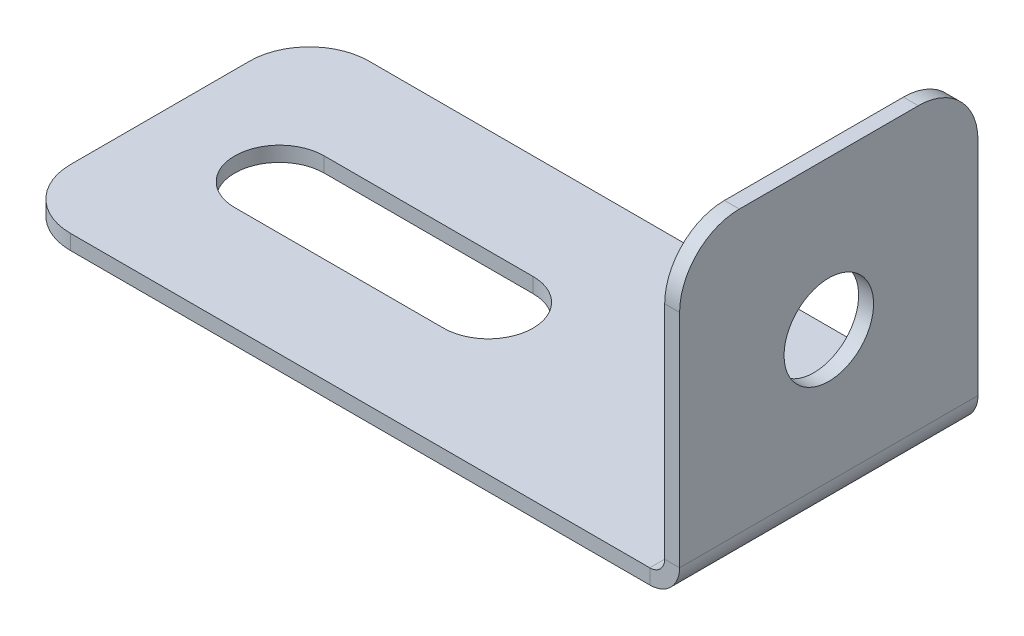
ISO-10303-21;
HEADER;
FILE_DESCRIPTION(('STEP AP214'),'2;1');
FILE_NAME('part.step','',(''),(''),'','','');
FILE_SCHEMA(('AUTOMOTIVE_DESIGN { 1 0 10303 214 1 1 1 1 }'));
ENDSEC;
DATA;
#1=APPLICATION_CONTEXT('core data for automotive mechanical design processes');
#2=APPLICATION_PROTOCOL_DEFINITION('international standard','automotive_design',2000,#1);
#3=PRODUCT_CONTEXT('',#1,'mechanical');
#4=PRODUCT('Part','Part','',(#3));
#5=PRODUCT_RELATED_PRODUCT_CATEGORY('part','',(#4));
#6=PRODUCT_DEFINITION_FORMATION('','',#4);
#7=PRODUCT_DEFINITION_CONTEXT('part definition',#1,'design');
#8=PRODUCT_DEFINITION('design','',#6,#7);
#9=PRODUCT_DEFINITION_SHAPE('','',#8);
#10=(LENGTH_UNIT() NAMED_UNIT(*) SI_UNIT(.MILLI.,.METRE.));
#11=(NAMED_UNIT(*) PLANE_ANGLE_UNIT() SI_UNIT($,.RADIAN.));
#12=(NAMED_UNIT(*) SI_UNIT($,.STERADIAN.) SOLID_ANGLE_UNIT());
#13=UNCERTAINTY_MEASURE_WITH_UNIT(LENGTH_MEASURE(1.E-05),#10,'distance_accuracy_value','');
#14=(GEOMETRIC_REPRESENTATION_CONTEXT(3) GLOBAL_UNCERTAINTY_ASSIGNED_CONTEXT((#13)) GLOBAL_UNIT_ASSIGNED_CONTEXT((#10,
#11,#12)) REPRESENTATION_CONTEXT('',''));
#15=CARTESIAN_POINT('',(0.,0.,0.));
#16=DIRECTION('',(0.,0.,1.));
#17=DIRECTION('',(1.,0.,0.));
#18=AXIS2_PLACEMENT_3D('',#15,#16,#17);
#19=CARTESIAN_POINT('',(6.41095137745193,-5.58904862254808,0.));
#20=DIRECTION('',(-1.,0.,0.));
#21=DIRECTION('',(0.,0.,1.));
#22=AXIS2_PLACEMENT_3D('',#19,#20,#21);
#23=PLANE('',#22);
#24=CARTESIAN_POINT('',(6.4109513774519,5.41095137745192,0.));
#25=DIRECTION('',(-1.,0.,0.));
#26=DIRECTION('',(0.,0.,1.));
#27=AXIS2_PLACEMENT_3D('',#24,#25,#26);
#28=CIRCLE('',#27,1.5);
#29=CARTESIAN_POINT('',(6.4109513774519,5.41095137745192,1.5));
#30=VERTEX_POINT('',#29);
#31=EDGE_CURVE('E225',#30,#30,#28,.T.);
#32=ORIENTED_EDGE('',*,*,#31,.T.);
#33=EDGE_LOOP('',(#32));
#34=FACE_BOUND('',#33,.T.);
#35=DIRECTION('',(0.,1.,0.));
#36=VECTOR('',#35,1.);
#37=CARTESIAN_POINT('',(6.41095137745193,-5.58904862254808,-5.));
#38=LINE('',#37,#36);
#39=CARTESIAN_POINT('',(6.41095137745189,8.41095137745192,-5.));
#40=VERTEX_POINT('',#39);
#41=CARTESIAN_POINT('',(6.41095137745191,1.,-5.));
#42=VERTEX_POINT('',#41);
#43=EDGE_CURVE('E233',#40,#42,#38,.F.);
#44=ORIENTED_EDGE('',*,*,#43,.F.);
#45=CARTESIAN_POINT('',(6.41095137745188,8.41095137745192,-3.));
#46=DIRECTION('',(-1.,0.,0.));
#47=DIRECTION('',(0.,-1.,0.));
#48=AXIS2_PLACEMENT_3D('',#45,#46,#47);
#49=CIRCLE('',#48,2.);
#50=CARTESIAN_POINT('',(6.41095137745188,10.4109513774519,-3.));
#51=VERTEX_POINT('',#50);
#52=EDGE_CURVE('E266',#40,#51,#49,.F.);
#53=ORIENTED_EDGE('',*,*,#52,.T.);
#54=DIRECTION('',(0.,0.,1.));
#55=VECTOR('',#54,1.);
#56=CARTESIAN_POINT('',(6.41095137745188,10.4109513774519,0.));
#57=LINE('',#56,#55);
#58=CARTESIAN_POINT('',(6.41095137745188,10.4109513774519,3.));
#59=VERTEX_POINT('',#58);
#60=EDGE_CURVE('E230',#59,#51,#57,.F.);
#61=ORIENTED_EDGE('',*,*,#60,.F.);
#62=CARTESIAN_POINT('',(6.41095137745188,8.41095137745192,3.));
#63=DIRECTION('',(-1.,0.,0.));
#64=DIRECTION('',(0.,-1.,0.));
#65=AXIS2_PLACEMENT_3D('',#62,#63,#64);
#66=CIRCLE('',#65,2.);
#67=CARTESIAN_POINT('',(6.41095137745188,8.41095137745191,5.));
#68=VERTEX_POINT('',#67);
#69=EDGE_CURVE('E264',#59,#68,#66,.F.);
#70=ORIENTED_EDGE('',*,*,#69,.T.);
#71=DIRECTION('',(0.,1.,0.));
#72=VECTOR('',#71,1.);
#73=CARTESIAN_POINT('',(6.41095137745193,-5.58904862254808,5.));
#74=LINE('',#73,#72);
#75=CARTESIAN_POINT('',(6.41095137745191,1.00000000000001,5.));
#76=VERTEX_POINT('',#75);
#77=EDGE_CURVE('E237',#76,#68,#74,.T.);
#78=ORIENTED_EDGE('',*,*,#77,.F.);
#79=DIRECTION('',(0.,0.,-1.));
#80=VECTOR('',#79,1.);
#81=CARTESIAN_POINT('',(6.41095137745191,1.00000000000001,0.));
#82=LINE('',#81,#80);
#83=EDGE_CURVE('E241',#76,#42,#82,.T.);
#84=ORIENTED_EDGE('',*,*,#83,.T.);
#85=EDGE_LOOP('',(#44,#53,#61,#70,#78,#84));
#86=FACE_BOUND('',#85,.T.);
#87=ADVANCED_FACE('F43',(#34,#86),#23,.F.);
#88=CARTESIAN_POINT('',(5.91095137745199,-21.5890486225481,5.));
#89=DIRECTION('',(0.,0.,1.));
#90=DIRECTION('',(0.,1.,0.));
#91=AXIS2_PLACEMENT_3D('',#88,#89,#90);
#92=PLANE('',#91);
#93=ORIENTED_EDGE('',*,*,#77,.T.);
#94=DIRECTION('',(-1.,0.,0.));
#95=VECTOR('',#94,1.);
#96=CARTESIAN_POINT('',(5.91095137745188,8.41095137745191,5.));
#97=LINE('',#96,#95);
#98=CARTESIAN_POINT('',(5.91095137745188,8.41095137745191,5.));
#99=VERTEX_POINT('',#98);
#100=EDGE_CURVE('E12',#68,#99,#97,.T.);
#101=ORIENTED_EDGE('',*,*,#100,.T.);
#102=DIRECTION('',(0.,1.,0.));
#103=VECTOR('',#102,1.);
#104=CARTESIAN_POINT('',(5.91095137745199,-21.5890486225481,5.));
#105=LINE('',#104,#103);
#106=CARTESIAN_POINT('',(5.91095137745191,1.,5.));
#107=VERTEX_POINT('',#106);
#108=EDGE_CURVE('E229',#107,#99,#105,.T.);
#109=ORIENTED_EDGE('',*,*,#108,.F.);
#110=DIRECTION('',(-1.,0.,0.));
#111=VECTOR('',#110,1.);
#112=CARTESIAN_POINT('',(5.91095137745191,1.,5.));
#113=LINE('',#112,#111);
#114=EDGE_CURVE('E244',#76,#107,#113,.T.);
#115=ORIENTED_EDGE('',*,*,#114,.F.);
#116=EDGE_LOOP('',(#93,#101,#109,#115));
#117=FACE_BOUND('',#116,.T.);
#118=ADVANCED_FACE('F344',(#117),#92,.T.);
#119=CARTESIAN_POINT('',(5.91095137745188,10.4109513774519,-5.));
#120=DIRECTION('',(0.,1.,0.));
#121=DIRECTION('',(0.,0.,-1.));
#122=AXIS2_PLACEMENT_3D('',#119,#120,#121);
#123=PLANE('',#122);
#124=ORIENTED_EDGE('',*,*,#60,.T.);
#125=DIRECTION('',(-1.,0.,0.));
#126=VECTOR('',#125,1.);
#127=CARTESIAN_POINT('',(5.91095137745188,10.4109513774519,-3.));
#128=LINE('',#127,#126);
#129=CARTESIAN_POINT('',(5.91095137745188,10.4109513774519,-3.));
#130=VERTEX_POINT('',#129);
#131=EDGE_CURVE('E255',#51,#130,#128,.T.);
#132=ORIENTED_EDGE('',*,*,#131,.T.);
#133=DIRECTION('',(0.,0.,-1.));
#134=VECTOR('',#133,1.);
#135=CARTESIAN_POINT('',(5.91095137745188,10.4109513774519,-5.));
#136=LINE('',#135,#134);
#137=CARTESIAN_POINT('',(5.91095137745188,10.4109513774519,3.));
#138=VERTEX_POINT('',#137);
#139=EDGE_CURVE('E221',#138,#130,#136,.T.);
#140=ORIENTED_EDGE('',*,*,#139,.F.);
#141=DIRECTION('',(-1.,0.,0.));
#142=VECTOR('',#141,1.);
#143=CARTESIAN_POINT('',(5.91095137745188,10.4109513774519,3.));
#144=LINE('',#143,#142);
#145=EDGE_CURVE('E247',#138,#59,#144,.F.);
#146=ORIENTED_EDGE('',*,*,#145,.T.);
#147=EDGE_LOOP('',(#124,#132,#140,#146));
#148=FACE_BOUND('',#147,.T.);
#149=ADVANCED_FACE('F350',(#148),#123,.T.);
#150=CARTESIAN_POINT('',(5.91095137745199,-21.5890486225481,-5.));
#151=DIRECTION('',(0.,0.,-1.));
#152=DIRECTION('',(0.,-1.,0.));
#153=AXIS2_PLACEMENT_3D('',#150,#151,#152);
#154=PLANE('',#153);
#155=DIRECTION('',(0.,-1.,0.));
#156=VECTOR('',#155,1.);
#157=CARTESIAN_POINT('',(5.91095137745199,-21.5890486225481,-5.));
#158=LINE('',#157,#156);
#159=CARTESIAN_POINT('',(5.91095137745188,8.41095137745191,-5.));
#160=VERTEX_POINT('',#159);
#161=CARTESIAN_POINT('',(5.91095137745191,1.,-5.));
#162=VERTEX_POINT('',#161);
#163=EDGE_CURVE('E224',#160,#162,#158,.T.);
#164=ORIENTED_EDGE('',*,*,#163,.F.);
#165=DIRECTION('',(-1.,0.,0.));
#166=VECTOR('',#165,1.);
#167=CARTESIAN_POINT('',(5.91095137745188,8.41095137745191,-5.));
#168=LINE('',#167,#166);
#169=EDGE_CURVE('E262',#160,#40,#168,.F.);
#170=ORIENTED_EDGE('',*,*,#169,.T.);
#171=ORIENTED_EDGE('',*,*,#43,.T.);
#172=DIRECTION('',(1.,0.,0.));
#173=VECTOR('',#172,1.);
#174=CARTESIAN_POINT('',(5.91095137745191,1.00000000000001,-5.));
#175=LINE('',#174,#173);
#176=EDGE_CURVE('E239',#162,#42,#175,.T.);
#177=ORIENTED_EDGE('',*,*,#176,.F.);
#178=EDGE_LOOP('',(#164,#170,#171,#177));
#179=FACE_BOUND('',#178,.T.);
#180=ADVANCED_FACE('F355',(#179),#154,.T.);
#181=CARTESIAN_POINT('',(5.91095137745189,5.41095137745192,0.));
#182=DIRECTION('',(-1.,0.,0.));
#183=DIRECTION('',(0.,0.,1.));
#184=AXIS2_PLACEMENT_3D('',#181,#182,#183);
#185=CYLINDRICAL_SURFACE('',#184,1.5);
#186=CARTESIAN_POINT('',(5.91095137745189,5.41095137745192,0.));
#187=DIRECTION('',(-1.,0.,0.));
#188=DIRECTION('',(0.,0.,1.));
#189=AXIS2_PLACEMENT_3D('',#186,#187,#188);
#190=CIRCLE('',#189,1.5);
#191=CARTESIAN_POINT('',(5.91095137745189,5.41095137745192,1.5));
#192=VERTEX_POINT('',#191);
#193=EDGE_CURVE('E226',#192,#192,#190,.T.);
#194=ORIENTED_EDGE('',*,*,#193,.T.);
#195=EDGE_LOOP('',(#194));
#196=FACE_BOUND('',#195,.T.);
#197=ORIENTED_EDGE('',*,*,#31,.F.);
#198=EDGE_LOOP('',(#197));
#199=FACE_BOUND('',#198,.T.);
#200=ADVANCED_FACE('F475',(#196,#199),#185,.F.);
#201=CARTESIAN_POINT('',(5.91095137745193,-5.58904862254808,0.));
#202=DIRECTION('',(-1.,0.,0.));
#203=DIRECTION('',(0.,0.,1.));
#204=AXIS2_PLACEMENT_3D('',#201,#202,#203);
#205=PLANE('',#204);
#206=ORIENTED_EDGE('',*,*,#139,.T.);
#207=CARTESIAN_POINT('',(5.91095137745188,8.41095137745192,-3.));
#208=DIRECTION('',(-1.,0.,0.));
#209=DIRECTION('',(0.,-1.,0.));
#210=AXIS2_PLACEMENT_3D('',#207,#208,#209);
#211=CIRCLE('',#210,2.);
#212=EDGE_CURVE('E260',#130,#160,#211,.T.);
#213=ORIENTED_EDGE('',*,*,#212,.T.);
#214=ORIENTED_EDGE('',*,*,#163,.T.);
#215=DIRECTION('',(0.,0.,-1.));
#216=VECTOR('',#215,1.);
#217=CARTESIAN_POINT('',(5.91095137745191,1.,0.));
#218=LINE('',#217,#216);
#219=EDGE_CURVE('E179',#107,#162,#218,.T.);
#220=ORIENTED_EDGE('',*,*,#219,.F.);
#221=ORIENTED_EDGE('',*,*,#108,.T.);
#222=CARTESIAN_POINT('',(5.91095137745188,8.41095137745191,3.));
#223=DIRECTION('',(-1.,0.,0.));
#224=DIRECTION('',(0.,-1.,0.));
#225=AXIS2_PLACEMENT_3D('',#222,#223,#224);
#226=CIRCLE('',#225,2.);
#227=EDGE_CURVE('E258',#99,#138,#226,.T.);
#228=ORIENTED_EDGE('',*,*,#227,.T.);
#229=EDGE_LOOP('',(#206,#213,#214,#220,#221,#228));
#230=FACE_BOUND('',#229,.T.);
#231=ORIENTED_EDGE('',*,*,#193,.F.);
#232=EDGE_LOOP('',(#231));
#233=FACE_BOUND('',#232,.T.);
#234=ADVANCED_FACE('F396',(#230,#233),#205,.T.);
#235=CARTESIAN_POINT('',(-16.,0.5,-5.));
#236=DIRECTION('',(-1.,0.,0.));
#237=DIRECTION('',(0.,0.,1.));
#238=AXIS2_PLACEMENT_3D('',#235,#236,#237);
#239=PLANE('',#238);
#240=DIRECTION('',(0.,0.,1.));
#241=VECTOR('',#240,1.);
#242=CARTESIAN_POINT('',(-16.,0.5,-5.));
#243=LINE('',#242,#241);
#244=CARTESIAN_POINT('',(-16.,0.5,-3.));
#245=VERTEX_POINT('',#244);
#246=CARTESIAN_POINT('',(-16.,0.5,3.));
#247=VERTEX_POINT('',#246);
#248=EDGE_CURVE('E169',#245,#247,#243,.T.);
#249=ORIENTED_EDGE('',*,*,#248,.F.);
#250=DIRECTION('',(0.,1.,0.));
#251=VECTOR('',#250,1.);
#252=CARTESIAN_POINT('',(-16.,0.5,-3.));
#253=LINE('',#252,#251);
#254=CARTESIAN_POINT('',(-16.,0.,-3.));
#255=VERTEX_POINT('',#254);
#256=EDGE_CURVE('E276',#245,#255,#253,.F.);
#257=ORIENTED_EDGE('',*,*,#256,.T.);
#258=DIRECTION('',(0.,0.,1.));
#259=VECTOR('',#258,1.);
#260=CARTESIAN_POINT('',(-16.,0.,0.));
#261=LINE('',#260,#259);
#262=CARTESIAN_POINT('',(-16.,0.,3.));
#263=VERTEX_POINT('',#262);
#264=EDGE_CURVE('E218',#255,#263,#261,.T.);
#265=ORIENTED_EDGE('',*,*,#264,.T.);
#266=DIRECTION('',(0.,1.,0.));
#267=VECTOR('',#266,1.);
#268=CARTESIAN_POINT('',(-16.,0.5,3.));
#269=LINE('',#268,#267);
#270=EDGE_CURVE('E273',#263,#247,#269,.T.);
#271=ORIENTED_EDGE('',*,*,#270,.T.);
#272=EDGE_LOOP('',(#249,#257,#265,#271));
#273=FACE_BOUND('',#272,.T.);
#274=ADVANCED_FACE('F292',(#273),#239,.T.);
#275=CARTESIAN_POINT('',(-5.,0.5,0.));
#276=DIRECTION('',(0.,1.,0.));
#277=DIRECTION('',(0.,0.,1.));
#278=AXIS2_PLACEMENT_3D('',#275,#276,#277);
#279=CYLINDRICAL_SURFACE('',#278,1.5);
#280=DIRECTION('',(0.,1.,0.));
#281=VECTOR('',#280,1.);
#282=CARTESIAN_POINT('',(-5.,0.5,-1.5));
#283=LINE('',#282,#281);
#284=CARTESIAN_POINT('',(-5.,0.,-1.5));
#285=VERTEX_POINT('',#284);
#286=CARTESIAN_POINT('',(-5.,0.5,-1.5));
#287=VERTEX_POINT('',#286);
#288=EDGE_CURVE('E211',#285,#287,#283,.T.);
#289=ORIENTED_EDGE('',*,*,#288,.F.);
#290=CARTESIAN_POINT('',(-5.,0.,0.));
#291=DIRECTION('',(0.,1.,0.));
#292=DIRECTION('',(0.,0.,1.));
#293=AXIS2_PLACEMENT_3D('',#290,#291,#292);
#294=CIRCLE('',#293,1.5);
#295=CARTESIAN_POINT('',(-5.,0.,1.5));
#296=VERTEX_POINT('',#295);
#297=EDGE_CURVE('E314',#296,#285,#294,.T.);
#298=ORIENTED_EDGE('',*,*,#297,.F.);
#299=DIRECTION('',(0.,1.,0.));
#300=VECTOR('',#299,1.);
#301=CARTESIAN_POINT('',(-5.,0.5,1.5));
#302=LINE('',#301,#300);
#303=CARTESIAN_POINT('',(-5.,0.5,1.5));
#304=VERTEX_POINT('',#303);
#305=EDGE_CURVE('E216',#296,#304,#302,.T.);
#306=ORIENTED_EDGE('',*,*,#305,.T.);
#307=CARTESIAN_POINT('',(-5.,0.5,0.));
#308=DIRECTION('',(0.,1.,0.));
#309=DIRECTION('',(0.,0.,1.));
#310=AXIS2_PLACEMENT_3D('',#307,#308,#309);
#311=CIRCLE('',#310,1.5);
#312=EDGE_CURVE('E213',#304,#287,#311,.T.);
#313=ORIENTED_EDGE('',*,*,#312,.T.);
#314=EDGE_LOOP('',(#289,#298,#306,#313));
#315=FACE_BOUND('',#314,.T.);
#316=ADVANCED_FACE('F323',(#315),#279,.F.);
#317=CARTESIAN_POINT('',(-12.,0.5,-1.5));
#318=DIRECTION('',(0.,0.,-1.));
#319=DIRECTION('',(-1.,0.,0.));
#320=AXIS2_PLACEMENT_3D('',#317,#318,#319);
#321=PLANE('',#320);
#322=DIRECTION('',(0.,1.,0.));
#323=VECTOR('',#322,1.);
#324=CARTESIAN_POINT('',(-12.,0.5,-1.5));
#325=LINE('',#324,#323);
#326=CARTESIAN_POINT('',(-12.,0.,-1.5));
#327=VERTEX_POINT('',#326);
#328=CARTESIAN_POINT('',(-12.,0.5,-1.5));
#329=VERTEX_POINT('',#328);
#330=EDGE_CURVE('E206',#327,#329,#325,.T.);
#331=ORIENTED_EDGE('',*,*,#330,.F.);
#332=DIRECTION('',(1.,0.,0.));
#333=VECTOR('',#332,1.);
#334=CARTESIAN_POINT('',(0.,0.,-1.5));
#335=LINE('',#334,#333);
#336=EDGE_CURVE('E311',#285,#327,#335,.F.);
#337=ORIENTED_EDGE('',*,*,#336,.F.);
#338=ORIENTED_EDGE('',*,*,#288,.T.);
#339=DIRECTION('',(-1.,0.,0.));
#340=VECTOR('',#339,1.);
#341=CARTESIAN_POINT('',(-12.,0.5,-1.5));
#342=LINE('',#341,#340);
#343=EDGE_CURVE('E208',#287,#329,#342,.T.);
#344=ORIENTED_EDGE('',*,*,#343,.T.);
#345=EDGE_LOOP('',(#331,#337,#338,#344));
#346=FACE_BOUND('',#345,.T.);
#347=ADVANCED_FACE('F328',(#346),#321,.F.);
#348=CARTESIAN_POINT('',(-12.,0.5,0.));
#349=DIRECTION('',(0.,1.,0.));
#350=DIRECTION('',(0.,0.,1.));
#351=AXIS2_PLACEMENT_3D('',#348,#349,#350);
#352=CYLINDRICAL_SURFACE('',#351,1.5);
#353=CARTESIAN_POINT('',(-12.,0.,0.));
#354=DIRECTION('',(0.,1.,0.));
#355=DIRECTION('',(0.,0.,1.));
#356=AXIS2_PLACEMENT_3D('',#353,#354,#355);
#357=CIRCLE('',#356,1.5);
#358=CARTESIAN_POINT('',(-12.,0.,1.5));
#359=VERTEX_POINT('',#358);
#360=EDGE_CURVE('E304',#327,#359,#357,.T.);
#361=ORIENTED_EDGE('',*,*,#360,.F.);
#362=ORIENTED_EDGE('',*,*,#330,.T.);
#363=CARTESIAN_POINT('',(-12.,0.5,0.));
#364=DIRECTION('',(0.,1.,0.));
#365=DIRECTION('',(0.,0.,1.));
#366=AXIS2_PLACEMENT_3D('',#363,#364,#365);
#367=CIRCLE('',#366,1.5);
#368=CARTESIAN_POINT('',(-12.,0.5,1.5));
#369=VERTEX_POINT('',#368);
#370=EDGE_CURVE('E203',#329,#369,#367,.T.);
#371=ORIENTED_EDGE('',*,*,#370,.T.);
#372=DIRECTION('',(0.,1.,0.));
#373=VECTOR('',#372,1.);
#374=CARTESIAN_POINT('',(-12.,0.5,1.5));
#375=LINE('',#374,#373);
#376=EDGE_CURVE('E201',#359,#369,#375,.T.);
#377=ORIENTED_EDGE('',*,*,#376,.F.);
#378=EDGE_LOOP('',(#361,#362,#371,#377));
#379=FACE_BOUND('',#378,.T.);
#380=ADVANCED_FACE('F330',(#379),#352,.F.);
#381=CARTESIAN_POINT('',(-12.,0.5,1.5));
#382=DIRECTION('',(0.,0.,1.));
#383=DIRECTION('',(1.,0.,0.));
#384=AXIS2_PLACEMENT_3D('',#381,#382,#383);
#385=PLANE('',#384);
#386=ORIENTED_EDGE('',*,*,#305,.F.);
#387=DIRECTION('',(1.,0.,0.));
#388=VECTOR('',#387,1.);
#389=CARTESIAN_POINT('',(0.,0.,1.5));
#390=LINE('',#389,#388);
#391=EDGE_CURVE('E287',#359,#296,#390,.T.);
#392=ORIENTED_EDGE('',*,*,#391,.F.);
#393=ORIENTED_EDGE('',*,*,#376,.T.);
#394=DIRECTION('',(1.,0.,0.));
#395=VECTOR('',#394,1.);
#396=CARTESIAN_POINT('',(-12.,0.5,1.5));
#397=LINE('',#396,#395);
#398=EDGE_CURVE('E198',#369,#304,#397,.T.);
#399=ORIENTED_EDGE('',*,*,#398,.T.);
#400=EDGE_LOOP('',(#386,#392,#393,#399));
#401=FACE_BOUND('',#400,.T.);
#402=ADVANCED_FACE('F333',(#401),#385,.F.);
#403=CARTESIAN_POINT('',(0.,0.5,0.));
#404=DIRECTION('',(0.,1.,0.));
#405=DIRECTION('',(0.,0.,1.));
#406=AXIS2_PLACEMENT_3D('',#403,#404,#405);
#407=PLANE('',#406);
#408=ORIENTED_EDGE('',*,*,#398,.F.);
#409=ORIENTED_EDGE('',*,*,#370,.F.);
#410=ORIENTED_EDGE('',*,*,#343,.F.);
#411=ORIENTED_EDGE('',*,*,#312,.F.);
#412=EDGE_LOOP('',(#408,#409,#410,#411));
#413=FACE_BOUND('',#412,.T.);
#414=DIRECTION('',(-1.,0.,0.));
#415=VECTOR('',#414,1.);
#416=CARTESIAN_POINT('',(-16.,0.5,-5.));
#417=LINE('',#416,#415);
#418=CARTESIAN_POINT('',(5.41095137745191,0.5,-5.));
#419=VERTEX_POINT('',#418);
#420=CARTESIAN_POINT('',(-14.,0.5,-5.));
#421=VERTEX_POINT('',#420);
#422=EDGE_CURVE('E186',#419,#421,#417,.T.);
#423=ORIENTED_EDGE('',*,*,#422,.T.);
#424=CARTESIAN_POINT('',(-14.,0.5,-3.));
#425=DIRECTION('',(0.,1.,0.));
#426=DIRECTION('',(0.,0.,1.));
#427=AXIS2_PLACEMENT_3D('',#424,#425,#426);
#428=CIRCLE('',#427,2.);
#429=EDGE_CURVE('E271',#421,#245,#428,.T.);
#430=ORIENTED_EDGE('',*,*,#429,.T.);
#431=ORIENTED_EDGE('',*,*,#248,.T.);
#432=CARTESIAN_POINT('',(-14.,0.5,3.));
#433=DIRECTION('',(0.,1.,0.));
#434=DIRECTION('',(0.,0.,1.));
#435=AXIS2_PLACEMENT_3D('',#432,#433,#434);
#436=CIRCLE('',#435,2.);
#437=CARTESIAN_POINT('',(-14.,0.5,5.));
#438=VERTEX_POINT('',#437);
#439=EDGE_CURVE('E269',#247,#438,#436,.T.);
#440=ORIENTED_EDGE('',*,*,#439,.T.);
#441=DIRECTION('',(1.,0.,0.));
#442=VECTOR('',#441,1.);
#443=CARTESIAN_POINT('',(-16.,0.5,5.));
#444=LINE('',#443,#442);
#445=CARTESIAN_POINT('',(5.41095137745191,0.5,5.));
#446=VERTEX_POINT('',#445);
#447=EDGE_CURVE('E187',#438,#446,#444,.T.);
#448=ORIENTED_EDGE('',*,*,#447,.T.);
#449=DIRECTION('',(0.,0.,-1.));
#450=VECTOR('',#449,1.);
#451=CARTESIAN_POINT('',(5.41095137745191,0.5,0.));
#452=LINE('',#451,#450);
#453=EDGE_CURVE('E177',#446,#419,#452,.T.);
#454=ORIENTED_EDGE('',*,*,#453,.T.);
#455=EDGE_LOOP('',(#423,#430,#431,#440,#448,#454));
#456=FACE_BOUND('',#455,.T.);
#457=ADVANCED_FACE('F185',(#413,#456),#407,.T.);
#458=CARTESIAN_POINT('',(-16.,0.5,-5.));
#459=DIRECTION('',(0.,0.,-1.));
#460=DIRECTION('',(-1.,0.,0.));
#461=AXIS2_PLACEMENT_3D('',#458,#459,#460);
#462=PLANE('',#461);
#463=DIRECTION('',(1.,0.,0.));
#464=VECTOR('',#463,1.);
#465=CARTESIAN_POINT('',(0.,0.,-5.));
#466=LINE('',#465,#464);
#467=CARTESIAN_POINT('',(5.41095137745191,0.,-5.));
#468=VERTEX_POINT('',#467);
#469=CARTESIAN_POINT('',(-14.,0.,-5.));
#470=VERTEX_POINT('',#469);
#471=EDGE_CURVE('E168',#468,#470,#466,.F.);
#472=ORIENTED_EDGE('',*,*,#471,.T.);
#473=DIRECTION('',(0.,1.,0.));
#474=VECTOR('',#473,1.);
#475=CARTESIAN_POINT('',(-14.,0.5,-5.));
#476=LINE('',#475,#474);
#477=EDGE_CURVE('E192',#470,#421,#476,.T.);
#478=ORIENTED_EDGE('',*,*,#477,.T.);
#479=ORIENTED_EDGE('',*,*,#422,.F.);
#480=DIRECTION('',(0.,-1.,0.));
#481=VECTOR('',#480,1.);
#482=CARTESIAN_POINT('',(5.41095137745191,0.5,-5.));
#483=LINE('',#482,#481);
#484=EDGE_CURVE('E157',#419,#468,#483,.T.);
#485=ORIENTED_EDGE('',*,*,#484,.T.);
#486=EDGE_LOOP('',(#472,#478,#479,#485));
#487=FACE_BOUND('',#486,.T.);
#488=ADVANCED_FACE('F190',(#487),#462,.T.);
#489=CARTESIAN_POINT('',(0.,0.,0.));
#490=DIRECTION('',(0.,1.,0.));
#491=DIRECTION('',(0.,0.,1.));
#492=AXIS2_PLACEMENT_3D('',#489,#490,#491);
#493=PLANE('',#492);
#494=ORIENTED_EDGE('',*,*,#264,.F.);
#495=CARTESIAN_POINT('',(-14.,0.,-3.));
#496=DIRECTION('',(0.,1.,0.));
#497=DIRECTION('',(0.,0.,1.));
#498=AXIS2_PLACEMENT_3D('',#495,#496,#497);
#499=CIRCLE('',#498,2.);
#500=EDGE_CURVE('E279',#255,#470,#499,.F.);
#501=ORIENTED_EDGE('',*,*,#500,.T.);
#502=ORIENTED_EDGE('',*,*,#471,.F.);
#503=DIRECTION('',(0.,0.,-1.));
#504=VECTOR('',#503,1.);
#505=CARTESIAN_POINT('',(5.41095137745191,0.,0.));
#506=LINE('',#505,#504);
#507=CARTESIAN_POINT('',(5.41095137745191,0.,5.));
#508=VERTEX_POINT('',#507);
#509=EDGE_CURVE('E180',#508,#468,#506,.T.);
#510=ORIENTED_EDGE('',*,*,#509,.F.);
#511=DIRECTION('',(1.,0.,0.));
#512=VECTOR('',#511,1.);
#513=CARTESIAN_POINT('',(0.,0.,5.));
#514=LINE('',#513,#512);
#515=CARTESIAN_POINT('',(-14.,0.,5.));
#516=VERTEX_POINT('',#515);
#517=EDGE_CURVE('E299',#516,#508,#514,.T.);
#518=ORIENTED_EDGE('',*,*,#517,.F.);
#519=CARTESIAN_POINT('',(-14.,0.,3.));
#520=DIRECTION('',(0.,1.,0.));
#521=DIRECTION('',(0.,0.,1.));
#522=AXIS2_PLACEMENT_3D('',#519,#520,#521);
#523=CIRCLE('',#522,2.);
#524=EDGE_CURVE('E64',#516,#263,#523,.F.);
#525=ORIENTED_EDGE('',*,*,#524,.T.);
#526=EDGE_LOOP('',(#494,#501,#502,#510,#518,#525));
#527=FACE_BOUND('',#526,.T.);
#528=ORIENTED_EDGE('',*,*,#391,.T.);
#529=ORIENTED_EDGE('',*,*,#297,.T.);
#530=ORIENTED_EDGE('',*,*,#336,.T.);
#531=ORIENTED_EDGE('',*,*,#360,.T.);
#532=EDGE_LOOP('',(#528,#529,#530,#531));
#533=FACE_BOUND('',#532,.T.);
#534=ADVANCED_FACE('F282',(#527,#533),#493,.F.);
#535=CARTESIAN_POINT('',(-16.,0.5,5.));
#536=DIRECTION('',(0.,0.,1.));
#537=DIRECTION('',(1.,0.,0.));
#538=AXIS2_PLACEMENT_3D('',#535,#536,#537);
#539=PLANE('',#538);
#540=ORIENTED_EDGE('',*,*,#447,.F.);
#541=DIRECTION('',(0.,1.,0.));
#542=VECTOR('',#541,1.);
#543=CARTESIAN_POINT('',(-14.,0.5,5.));
#544=LINE('',#543,#542);
#545=EDGE_CURVE('E51',#438,#516,#544,.F.);
#546=ORIENTED_EDGE('',*,*,#545,.T.);
#547=ORIENTED_EDGE('',*,*,#517,.T.);
#548=DIRECTION('',(0.,1.,0.));
#549=VECTOR('',#548,1.);
#550=CARTESIAN_POINT('',(5.41095137745191,0.5,5.));
#551=LINE('',#550,#549);
#552=EDGE_CURVE('E234',#508,#446,#551,.T.);
#553=ORIENTED_EDGE('',*,*,#552,.T.);
#554=EDGE_LOOP('',(#540,#546,#547,#553));
#555=FACE_BOUND('',#554,.T.);
#556=ADVANCED_FACE('F297',(#555),#539,.T.);
#557=CARTESIAN_POINT('',(5.41095137745191,1.,5.));
#558=DIRECTION('',(0.,0.,-1.));
#559=DIRECTION('',(-1.,0.,0.));
#560=AXIS2_PLACEMENT_3D('',#557,#558,#559);
#561=PLANE('',#560);
#562=ORIENTED_EDGE('',*,*,#552,.F.);
#563=CARTESIAN_POINT('',(5.41095137745191,1.,5.));
#564=DIRECTION('',(0.,0.,-1.));
#565=DIRECTION('',(-1.,0.,0.));
#566=AXIS2_PLACEMENT_3D('',#563,#564,#565);
#567=CIRCLE('',#566,1.);
#568=EDGE_CURVE('E380',#508,#76,#567,.F.);
#569=ORIENTED_EDGE('',*,*,#568,.T.);
#570=ORIENTED_EDGE('',*,*,#114,.T.);
#571=CARTESIAN_POINT('',(5.41095137745191,1.,5.));
#572=DIRECTION('',(0.,0.,1.));
#573=DIRECTION('',(1.,0.,0.));
#574=AXIS2_PLACEMENT_3D('',#571,#572,#573);
#575=CIRCLE('',#574,0.5);
#576=EDGE_CURVE('E181',#446,#107,#575,.T.);
#577=ORIENTED_EDGE('',*,*,#576,.F.);
#578=EDGE_LOOP('',(#562,#569,#570,#577));
#579=FACE_BOUND('',#578,.T.);
#580=ADVANCED_FACE('F381',(#579),#561,.F.);
#581=CARTESIAN_POINT('',(5.41095137745191,1.,-5.));
#582=DIRECTION('',(0.,0.,1.));
#583=DIRECTION('',(1.,0.,0.));
#584=AXIS2_PLACEMENT_3D('',#581,#582,#583);
#585=PLANE('',#584);
#586=CARTESIAN_POINT('',(5.41095137745191,1.,-5.));
#587=DIRECTION('',(0.,0.,-1.));
#588=DIRECTION('',(-1.,0.,0.));
#589=AXIS2_PLACEMENT_3D('',#586,#587,#588);
#590=CIRCLE('',#589,1.);
#591=EDGE_CURVE('E163',#42,#468,#590,.T.);
#592=ORIENTED_EDGE('',*,*,#591,.T.);
#593=ORIENTED_EDGE('',*,*,#484,.F.);
#594=CARTESIAN_POINT('',(5.41095137745191,1.,-5.));
#595=DIRECTION('',(0.,0.,-1.));
#596=DIRECTION('',(-1.,0.,0.));
#597=AXIS2_PLACEMENT_3D('',#594,#595,#596);
#598=CIRCLE('',#597,0.5);
#599=EDGE_CURVE('E161',#162,#419,#598,.T.);
#600=ORIENTED_EDGE('',*,*,#599,.F.);
#601=ORIENTED_EDGE('',*,*,#176,.T.);
#602=EDGE_LOOP('',(#592,#593,#600,#601));
#603=FACE_BOUND('',#602,.T.);
#604=ADVANCED_FACE('F159',(#603),#585,.F.);
#605=CARTESIAN_POINT('',(5.41095137745191,1.,10.0815630295556));
#606=DIRECTION('',(0.,0.,-1.));
#607=DIRECTION('',(-1.,0.,0.));
#608=AXIS2_PLACEMENT_3D('',#605,#606,#607);
#609=CYLINDRICAL_SURFACE('',#608,0.5);
#610=ORIENTED_EDGE('',*,*,#219,.T.);
#611=ORIENTED_EDGE('',*,*,#599,.T.);
#612=ORIENTED_EDGE('',*,*,#453,.F.);
#613=ORIENTED_EDGE('',*,*,#576,.T.);
#614=EDGE_LOOP('',(#610,#611,#612,#613));
#615=FACE_BOUND('',#614,.T.);
#616=ADVANCED_FACE('F175',(#615),#609,.F.);
#617=CARTESIAN_POINT('',(5.41095137745191,1.,10.0815630295556));
#618=DIRECTION('',(0.,0.,-1.));
#619=DIRECTION('',(-1.,0.,0.));
#620=AXIS2_PLACEMENT_3D('',#617,#618,#619);
#621=CYLINDRICAL_SURFACE('',#620,1.);
#622=ORIENTED_EDGE('',*,*,#83,.F.);
#623=ORIENTED_EDGE('',*,*,#568,.F.);
#624=ORIENTED_EDGE('',*,*,#509,.T.);
#625=ORIENTED_EDGE('',*,*,#591,.F.);
#626=EDGE_LOOP('',(#622,#623,#624,#625));
#627=FACE_BOUND('',#626,.T.);
#628=ADVANCED_FACE('F361',(#627),#621,.T.);
#629=CARTESIAN_POINT('',(5.91095137745188,8.41095137745192,-3.));
#630=DIRECTION('',(-1.,0.,0.));
#631=DIRECTION('',(0.,-1.,0.));
#632=AXIS2_PLACEMENT_3D('',#629,#630,#631);
#633=CYLINDRICAL_SURFACE('',#632,2.);
#634=ORIENTED_EDGE('',*,*,#52,.F.);
#635=ORIENTED_EDGE('',*,*,#169,.F.);
#636=ORIENTED_EDGE('',*,*,#212,.F.);
#637=ORIENTED_EDGE('',*,*,#131,.F.);
#638=EDGE_LOOP('',(#634,#635,#636,#637));
#639=FACE_BOUND('',#638,.T.);
#640=ADVANCED_FACE('F358',(#639),#633,.T.);
#641=CARTESIAN_POINT('',(-14.,0.5,-3.));
#642=DIRECTION('',(0.,1.,0.));
#643=DIRECTION('',(0.,0.,1.));
#644=AXIS2_PLACEMENT_3D('',#641,#642,#643);
#645=CYLINDRICAL_SURFACE('',#644,2.);
#646=ORIENTED_EDGE('',*,*,#500,.F.);
#647=ORIENTED_EDGE('',*,*,#256,.F.);
#648=ORIENTED_EDGE('',*,*,#429,.F.);
#649=ORIENTED_EDGE('',*,*,#477,.F.);
#650=EDGE_LOOP('',(#646,#647,#648,#649));
#651=FACE_BOUND('',#650,.T.);
#652=ADVANCED_FACE('F289',(#651),#645,.T.);
#653=CARTESIAN_POINT('',(-14.,0.5,3.));
#654=DIRECTION('',(0.,1.,0.));
#655=DIRECTION('',(0.,0.,1.));
#656=AXIS2_PLACEMENT_3D('',#653,#654,#655);
#657=CYLINDRICAL_SURFACE('',#656,2.);
#658=ORIENTED_EDGE('',*,*,#524,.F.);
#659=ORIENTED_EDGE('',*,*,#545,.F.);
#660=ORIENTED_EDGE('',*,*,#439,.F.);
#661=ORIENTED_EDGE('',*,*,#270,.F.);
#662=EDGE_LOOP('',(#658,#659,#660,#661));
#663=FACE_BOUND('',#662,.T.);
#664=ADVANCED_FACE('F295',(#663),#657,.T.);
#665=CARTESIAN_POINT('',(5.91095137745188,8.41095137745191,3.));
#666=DIRECTION('',(-1.,0.,0.));
#667=DIRECTION('',(0.,-1.,0.));
#668=AXIS2_PLACEMENT_3D('',#665,#666,#667);
#669=CYLINDRICAL_SURFACE('',#668,2.);
#670=ORIENTED_EDGE('',*,*,#69,.F.);
#671=ORIENTED_EDGE('',*,*,#145,.F.);
#672=ORIENTED_EDGE('',*,*,#227,.F.);
#673=ORIENTED_EDGE('',*,*,#100,.F.);
#674=EDGE_LOOP('',(#670,#671,#672,#673));
#675=FACE_BOUND('',#674,.T.);
#676=ADVANCED_FACE('F45',(#675),#669,.T.);
#677=CLOSED_SHELL('',(#87,#118,#149,#180,#200,#234,#274,#316,#347,#380,#402,#457,#488,#534,#556,
#580,#604,#616,#628,#640,#652,#664,#676));
#678=MANIFOLD_SOLID_BREP('B2',#677);
#679=ADVANCED_BREP_SHAPE_REPRESENTATION('',(#18,#678),#14);
#680=SHAPE_DEFINITION_REPRESENTATION(#9,#679);
ENDSEC;
END-ISO-10303-21;
